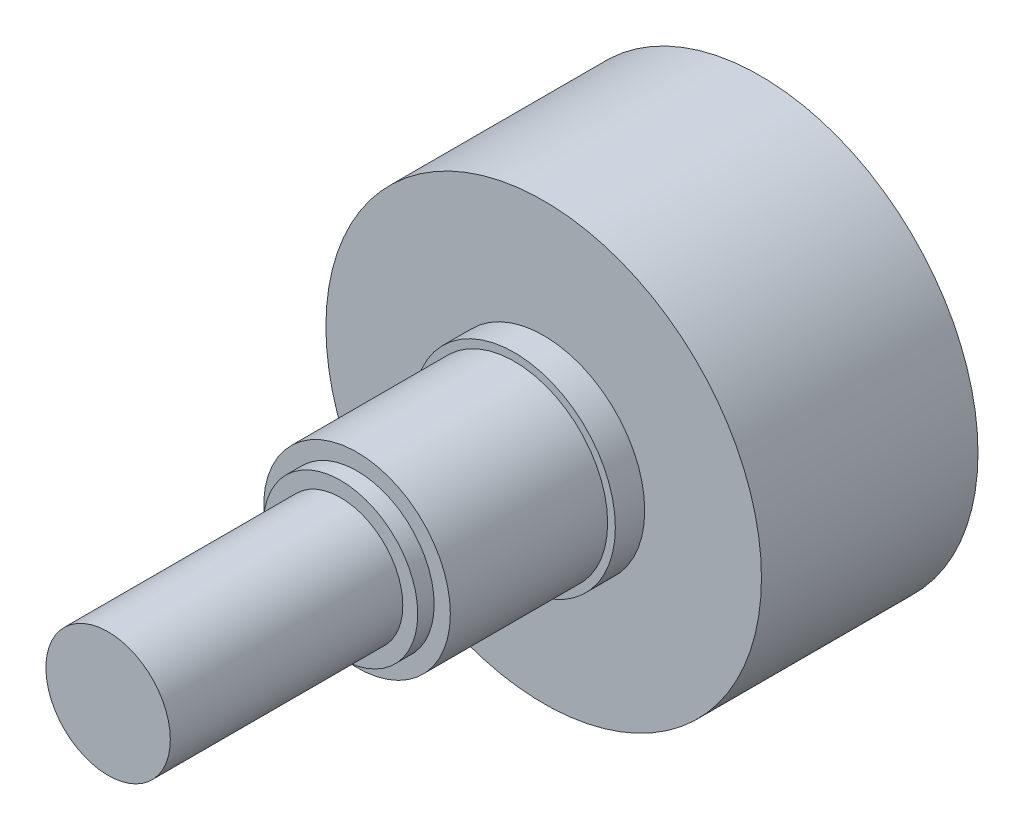
ISO-10303-21;
HEADER;
FILE_DESCRIPTION(('STEP AP214'),'2;1');
FILE_NAME('part.step','',(''),(''),'','','');
FILE_SCHEMA(('AUTOMOTIVE_DESIGN { 1 0 10303 214 1 1 1 1 }'));
ENDSEC;
DATA;
#1=APPLICATION_CONTEXT('core data for automotive mechanical design processes');
#2=APPLICATION_PROTOCOL_DEFINITION('international standard','automotive_design',2000,#1);
#3=PRODUCT_CONTEXT('',#1,'mechanical');
#4=PRODUCT('Part','Part','',(#3));
#5=PRODUCT_RELATED_PRODUCT_CATEGORY('part','',(#4));
#6=PRODUCT_DEFINITION_FORMATION('','',#4);
#7=PRODUCT_DEFINITION_CONTEXT('part definition',#1,'design');
#8=PRODUCT_DEFINITION('design','',#6,#7);
#9=PRODUCT_DEFINITION_SHAPE('','',#8);
#10=(LENGTH_UNIT() NAMED_UNIT(*) SI_UNIT(.MILLI.,.METRE.));
#11=(NAMED_UNIT(*) PLANE_ANGLE_UNIT() SI_UNIT($,.RADIAN.));
#12=(NAMED_UNIT(*) SI_UNIT($,.STERADIAN.) SOLID_ANGLE_UNIT());
#13=UNCERTAINTY_MEASURE_WITH_UNIT(LENGTH_MEASURE(1.E-05),#10,'distance_accuracy_value','');
#14=(GEOMETRIC_REPRESENTATION_CONTEXT(3) GLOBAL_UNCERTAINTY_ASSIGNED_CONTEXT((#13)) GLOBAL_UNIT_ASSIGNED_CONTEXT((#10,
#11,#12)) REPRESENTATION_CONTEXT('',''));
#15=CARTESIAN_POINT('',(0.,0.,0.));
#16=DIRECTION('',(0.,0.,1.));
#17=DIRECTION('',(1.,0.,0.));
#18=AXIS2_PLACEMENT_3D('',#15,#16,#17);
#19=CARTESIAN_POINT('',(0.,0.,21.4122));
#20=DIRECTION('',(0.,0.,1.));
#21=DIRECTION('',(1.,0.,0.));
#22=AXIS2_PLACEMENT_3D('',#19,#20,#21);
#23=PLANE('',#22);
#24=CARTESIAN_POINT('',(0.,0.,21.4122));
#25=DIRECTION('',(0.,0.,1.));
#26=DIRECTION('',(1.,0.,0.));
#27=AXIS2_PLACEMENT_3D('',#24,#25,#26);
#28=CIRCLE('',#27,3.937);
#29=CARTESIAN_POINT('',(3.937,0.,21.4122));
#30=VERTEX_POINT('',#29);
#31=EDGE_CURVE('E56',#30,#30,#28,.T.);
#32=ORIENTED_EDGE('',*,*,#31,.T.);
#33=EDGE_LOOP('',(#32));
#34=FACE_BOUND('',#33,.T.);
#35=CARTESIAN_POINT('',(0.,0.,21.4122));
#36=DIRECTION('',(0.,0.,1.));
#37=DIRECTION('',(1.,0.,0.));
#38=AXIS2_PLACEMENT_3D('',#35,#36,#37);
#39=CIRCLE('',#38,3.175);
#40=CARTESIAN_POINT('',(3.175,0.,21.4122));
#41=VERTEX_POINT('',#40);
#42=EDGE_CURVE('E35',#41,#41,#39,.F.);
#43=ORIENTED_EDGE('',*,*,#42,.T.);
#44=EDGE_LOOP('',(#43));
#45=FACE_BOUND('',#44,.T.);
#46=ADVANCED_FACE('F31',(#34,#45),#23,.T.);
#47=CARTESIAN_POINT('',(0.,0.,20.574));
#48=DIRECTION('',(0.,0.,1.));
#49=DIRECTION('',(1.,0.,0.));
#50=AXIS2_PLACEMENT_3D('',#47,#48,#49);
#51=PLANE('',#50);
#52=CARTESIAN_POINT('',(0.,0.,20.574));
#53=DIRECTION('',(0.,0.,1.));
#54=DIRECTION('',(1.,0.,0.));
#55=AXIS2_PLACEMENT_3D('',#52,#53,#54);
#56=CIRCLE('',#55,4.7625);
#57=CARTESIAN_POINT('',(4.7625,0.,20.574));
#58=VERTEX_POINT('',#57);
#59=EDGE_CURVE('E51',#58,#58,#56,.T.);
#60=ORIENTED_EDGE('',*,*,#59,.T.);
#61=EDGE_LOOP('',(#60));
#62=FACE_BOUND('',#61,.T.);
#63=CARTESIAN_POINT('',(0.,0.,20.574));
#64=DIRECTION('',(0.,0.,1.));
#65=DIRECTION('',(1.,0.,0.));
#66=AXIS2_PLACEMENT_3D('',#63,#64,#65);
#67=CIRCLE('',#66,3.937);
#68=CARTESIAN_POINT('',(3.937,0.,20.574));
#69=VERTEX_POINT('',#68);
#70=EDGE_CURVE('E61',#69,#69,#67,.T.);
#71=ORIENTED_EDGE('',*,*,#70,.F.);
#72=EDGE_LOOP('',(#71));
#73=FACE_BOUND('',#72,.T.);
#74=ADVANCED_FACE('F85',(#62,#73),#51,.T.);
#75=CARTESIAN_POINT('',(0.,0.,12.5476));
#76=DIRECTION('',(0.,0.,1.));
#77=DIRECTION('',(1.,0.,0.));
#78=AXIS2_PLACEMENT_3D('',#75,#76,#77);
#79=PLANE('',#78);
#80=CARTESIAN_POINT('',(0.,0.,12.5476));
#81=DIRECTION('',(0.,0.,1.));
#82=DIRECTION('',(1.,0.,0.));
#83=AXIS2_PLACEMENT_3D('',#80,#81,#82);
#84=CIRCLE('',#83,5.1562);
#85=CARTESIAN_POINT('',(5.1562,0.,12.5476));
#86=VERTEX_POINT('',#85);
#87=EDGE_CURVE('E44',#86,#86,#84,.T.);
#88=ORIENTED_EDGE('',*,*,#87,.T.);
#89=EDGE_LOOP('',(#88));
#90=FACE_BOUND('',#89,.T.);
#91=CARTESIAN_POINT('',(0.,0.,12.5476));
#92=DIRECTION('',(0.,0.,1.));
#93=DIRECTION('',(1.,0.,0.));
#94=AXIS2_PLACEMENT_3D('',#91,#92,#93);
#95=CIRCLE('',#94,4.7625);
#96=CARTESIAN_POINT('',(4.7625,0.,12.5476));
#97=VERTEX_POINT('',#96);
#98=EDGE_CURVE('E49',#97,#97,#95,.F.);
#99=ORIENTED_EDGE('',*,*,#98,.T.);
#100=EDGE_LOOP('',(#99));
#101=FACE_BOUND('',#100,.T.);
#102=ADVANCED_FACE('F67',(#90,#101),#79,.T.);
#103=CARTESIAN_POINT('',(0.,0.,11.049));
#104=DIRECTION('',(0.,0.,1.));
#105=DIRECTION('',(1.,0.,0.));
#106=AXIS2_PLACEMENT_3D('',#103,#104,#105);
#107=PLANE('',#106);
#108=CARTESIAN_POINT('',(0.,0.,11.049));
#109=DIRECTION('',(0.,0.,1.));
#110=DIRECTION('',(1.,0.,0.));
#111=AXIS2_PLACEMENT_3D('',#108,#109,#110);
#112=CIRCLE('',#111,11.1125);
#113=CARTESIAN_POINT('',(11.1125,0.,11.049));
#114=VERTEX_POINT('',#113);
#115=EDGE_CURVE('E10',#114,#114,#112,.T.);
#116=ORIENTED_EDGE('',*,*,#115,.T.);
#117=EDGE_LOOP('',(#116));
#118=FACE_BOUND('',#117,.T.);
#119=CARTESIAN_POINT('',(0.,0.,11.049));
#120=DIRECTION('',(0.,0.,1.));
#121=DIRECTION('',(1.,0.,0.));
#122=AXIS2_PLACEMENT_3D('',#119,#120,#121);
#123=CIRCLE('',#122,5.1562);
#124=CARTESIAN_POINT('',(5.1562,0.,11.049));
#125=VERTEX_POINT('',#124);
#126=EDGE_CURVE('E47',#125,#125,#123,.T.);
#127=ORIENTED_EDGE('',*,*,#126,.F.);
#128=EDGE_LOOP('',(#127));
#129=FACE_BOUND('',#128,.T.);
#130=ADVANCED_FACE('F77',(#118,#129),#107,.T.);
#131=CARTESIAN_POINT('',(0.,0.,11.049));
#132=DIRECTION('',(0.,0.,-1.));
#133=DIRECTION('',(-1.,0.,0.));
#134=AXIS2_PLACEMENT_3D('',#131,#132,#133);
#135=CYLINDRICAL_SURFACE('',#134,11.1125);
#136=ORIENTED_EDGE('',*,*,#115,.F.);
#137=EDGE_LOOP('',(#136));
#138=FACE_BOUND('',#137,.T.);
#139=CARTESIAN_POINT('',(0.,0.,0.));
#140=DIRECTION('',(0.,0.,1.));
#141=DIRECTION('',(1.,0.,0.));
#142=AXIS2_PLACEMENT_3D('',#139,#140,#141);
#143=CIRCLE('',#142,11.1125);
#144=CARTESIAN_POINT('',(11.1125,0.,0.));
#145=VERTEX_POINT('',#144);
#146=EDGE_CURVE('E39',#145,#145,#143,.T.);
#147=ORIENTED_EDGE('',*,*,#146,.T.);
#148=EDGE_LOOP('',(#147));
#149=FACE_BOUND('',#148,.T.);
#150=ADVANCED_FACE('F33',(#138,#149),#135,.T.);
#151=CARTESIAN_POINT('',(0.,0.,0.));
#152=DIRECTION('',(0.,0.,1.));
#153=DIRECTION('',(1.,0.,0.));
#154=AXIS2_PLACEMENT_3D('',#151,#152,#153);
#155=PLANE('',#154);
#156=ORIENTED_EDGE('',*,*,#146,.F.);
#157=EDGE_LOOP('',(#156));
#158=FACE_BOUND('',#157,.T.);
#159=ADVANCED_FACE('F73',(#158),#155,.F.);
#160=CARTESIAN_POINT('',(0.,0.,12.5476));
#161=DIRECTION('',(0.,0.,-1.));
#162=DIRECTION('',(-1.,0.,0.));
#163=AXIS2_PLACEMENT_3D('',#160,#161,#162);
#164=CYLINDRICAL_SURFACE('',#163,5.1562);
#165=ORIENTED_EDGE('',*,*,#87,.F.);
#166=EDGE_LOOP('',(#165));
#167=FACE_BOUND('',#166,.T.);
#168=ORIENTED_EDGE('',*,*,#126,.T.);
#169=EDGE_LOOP('',(#168));
#170=FACE_BOUND('',#169,.T.);
#171=ADVANCED_FACE('F69',(#167,#170),#164,.T.);
#172=CARTESIAN_POINT('',(0.,0.,20.574));
#173=DIRECTION('',(0.,0.,-1.));
#174=DIRECTION('',(-1.,0.,0.));
#175=AXIS2_PLACEMENT_3D('',#172,#173,#174);
#176=CYLINDRICAL_SURFACE('',#175,4.7625);
#177=ORIENTED_EDGE('',*,*,#98,.F.);
#178=EDGE_LOOP('',(#177));
#179=FACE_BOUND('',#178,.T.);
#180=ORIENTED_EDGE('',*,*,#59,.F.);
#181=EDGE_LOOP('',(#180));
#182=FACE_BOUND('',#181,.T.);
#183=ADVANCED_FACE('F72',(#179,#182),#176,.T.);
#184=CARTESIAN_POINT('',(0.,0.,21.4122));
#185=DIRECTION('',(0.,0.,-1.));
#186=DIRECTION('',(-1.,0.,0.));
#187=AXIS2_PLACEMENT_3D('',#184,#185,#186);
#188=CYLINDRICAL_SURFACE('',#187,3.937);
#189=ORIENTED_EDGE('',*,*,#31,.F.);
#190=EDGE_LOOP('',(#189));
#191=FACE_BOUND('',#190,.T.);
#192=ORIENTED_EDGE('',*,*,#70,.T.);
#193=EDGE_LOOP('',(#192));
#194=FACE_BOUND('',#193,.T.);
#195=ADVANCED_FACE('F101',(#191,#194),#188,.T.);
#196=CARTESIAN_POINT('',(0.,0.,33.274));
#197=DIRECTION('',(0.,0.,-1.));
#198=DIRECTION('',(-1.,0.,0.));
#199=AXIS2_PLACEMENT_3D('',#196,#197,#198);
#200=CYLINDRICAL_SURFACE('',#199,3.175);
#201=ORIENTED_EDGE('',*,*,#42,.F.);
#202=EDGE_LOOP('',(#201));
#203=FACE_BOUND('',#202,.T.);
#204=CARTESIAN_POINT('',(0.,0.,33.274));
#205=DIRECTION('',(0.,0.,1.));
#206=DIRECTION('',(1.,0.,0.));
#207=AXIS2_PLACEMENT_3D('',#204,#205,#206);
#208=CIRCLE('',#207,3.175);
#209=CARTESIAN_POINT('',(3.175,0.,33.274));
#210=VERTEX_POINT('',#209);
#211=EDGE_CURVE('E152',#210,#210,#208,.T.);
#212=ORIENTED_EDGE('',*,*,#211,.F.);
#213=EDGE_LOOP('',(#212));
#214=FACE_BOUND('',#213,.T.);
#215=ADVANCED_FACE('F99',(#203,#214),#200,.T.);
#216=CARTESIAN_POINT('',(0.,0.,33.274));
#217=DIRECTION('',(0.,0.,1.));
#218=DIRECTION('',(1.,0.,0.));
#219=AXIS2_PLACEMENT_3D('',#216,#217,#218);
#220=PLANE('',#219);
#221=ORIENTED_EDGE('',*,*,#211,.T.);
#222=EDGE_LOOP('',(#221));
#223=FACE_BOUND('',#222,.T.);
#224=ADVANCED_FACE('F138',(#223),#220,.T.);
#225=CLOSED_SHELL('',(#46,#74,#102,#130,#150,#159,#171,#183,#195,#215,#224));
#226=MANIFOLD_SOLID_BREP('B2',#225);
#227=ADVANCED_BREP_SHAPE_REPRESENTATION('',(#18,#226),#14);
#228=SHAPE_DEFINITION_REPRESENTATION(#9,#227);
ENDSEC;
END-ISO-10303-21;
